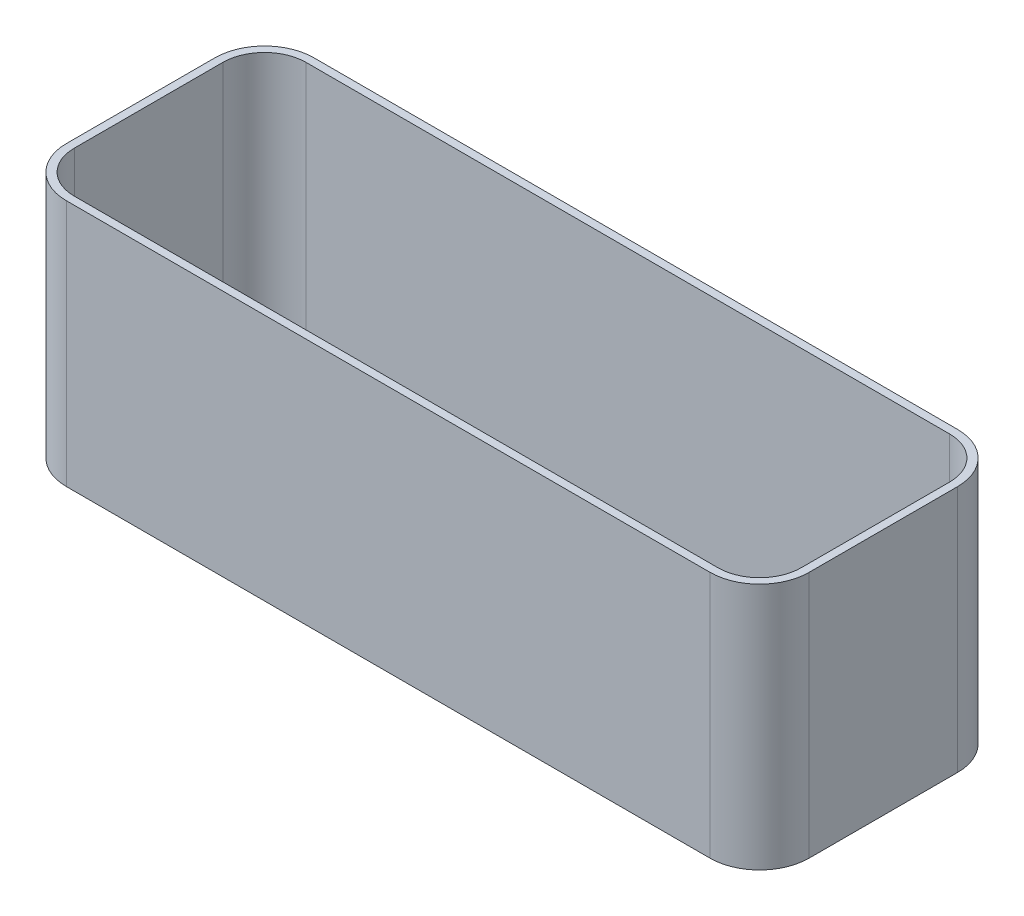
ISO-10303-21;
HEADER;
FILE_DESCRIPTION(('STEP AP214'),'2;1');
FILE_NAME('part.step','',(''),(''),'','','');
FILE_SCHEMA(('AUTOMOTIVE_DESIGN { 1 0 10303 214 1 1 1 1 }'));
ENDSEC;
DATA;
#1=APPLICATION_CONTEXT('core data for automotive mechanical design processes');
#2=APPLICATION_PROTOCOL_DEFINITION('international standard','automotive_design',2000,#1);
#3=PRODUCT_CONTEXT('',#1,'mechanical');
#4=PRODUCT('Part','Part','',(#3));
#5=PRODUCT_RELATED_PRODUCT_CATEGORY('part','',(#4));
#6=PRODUCT_DEFINITION_FORMATION('','',#4);
#7=PRODUCT_DEFINITION_CONTEXT('part definition',#1,'design');
#8=PRODUCT_DEFINITION('design','',#6,#7);
#9=PRODUCT_DEFINITION_SHAPE('','',#8);
#10=(LENGTH_UNIT() NAMED_UNIT(*) SI_UNIT(.MILLI.,.METRE.));
#11=(NAMED_UNIT(*) PLANE_ANGLE_UNIT() SI_UNIT($,.RADIAN.));
#12=(NAMED_UNIT(*) SI_UNIT($,.STERADIAN.) SOLID_ANGLE_UNIT());
#13=UNCERTAINTY_MEASURE_WITH_UNIT(LENGTH_MEASURE(1.E-05),#10,'distance_accuracy_value','');
#14=(GEOMETRIC_REPRESENTATION_CONTEXT(3) GLOBAL_UNCERTAINTY_ASSIGNED_CONTEXT((#13)) GLOBAL_UNIT_ASSIGNED_CONTEXT((#10,
#11,#12)) REPRESENTATION_CONTEXT('',''));
#15=CARTESIAN_POINT('',(0.,0.,0.));
#16=DIRECTION('',(0.,0.,1.));
#17=DIRECTION('',(1.,0.,0.));
#18=AXIS2_PLACEMENT_3D('',#15,#16,#17);
#19=CARTESIAN_POINT('',(140.,50.,-40.));
#20=DIRECTION('',(0.,-1.,0.));
#21=DIRECTION('',(0.,0.,-1.));
#22=AXIS2_PLACEMENT_3D('',#19,#20,#21);
#23=CYLINDRICAL_SURFACE('',#22,10.);
#24=CARTESIAN_POINT('',(140.,0.,-40.));
#25=DIRECTION('',(0.,1.,0.));
#26=DIRECTION('',(0.,0.,1.));
#27=AXIS2_PLACEMENT_3D('',#24,#25,#26);
#28=CIRCLE('',#27,10.);
#29=CARTESIAN_POINT('',(150.,0.,-39.9999999999999));
#30=VERTEX_POINT('',#29);
#31=CARTESIAN_POINT('',(140.,0.,-50.));
#32=VERTEX_POINT('',#31);
#33=EDGE_CURVE('E142',#30,#32,#28,.T.);
#34=ORIENTED_EDGE('',*,*,#33,.T.);
#35=DIRECTION('',(0.,-1.,0.));
#36=VECTOR('',#35,1.);
#37=CARTESIAN_POINT('',(140.,50.,-50.));
#38=LINE('',#37,#36);
#39=CARTESIAN_POINT('',(140.,50.,-50.));
#40=VERTEX_POINT('',#39);
#41=EDGE_CURVE('E11',#40,#32,#38,.T.);
#42=ORIENTED_EDGE('',*,*,#41,.F.);
#43=CARTESIAN_POINT('',(140.,50.,-40.));
#44=DIRECTION('',(0.,1.,0.));
#45=DIRECTION('',(0.,0.,1.));
#46=AXIS2_PLACEMENT_3D('',#43,#44,#45);
#47=CIRCLE('',#46,10.);
#48=CARTESIAN_POINT('',(150.,50.,-39.9999999999999));
#49=VERTEX_POINT('',#48);
#50=EDGE_CURVE('E158',#49,#40,#47,.T.);
#51=ORIENTED_EDGE('',*,*,#50,.F.);
#52=DIRECTION('',(0.,-1.,0.));
#53=VECTOR('',#52,1.);
#54=CARTESIAN_POINT('',(150.,50.,-39.9999999999999));
#55=LINE('',#54,#53);
#56=EDGE_CURVE('E138',#49,#30,#55,.T.);
#57=ORIENTED_EDGE('',*,*,#56,.T.);
#58=EDGE_LOOP('',(#34,#42,#51,#57));
#59=FACE_BOUND('',#58,.T.);
#60=ADVANCED_FACE('F35',(#59),#23,.T.);
#61=CARTESIAN_POINT('',(10.0000000000001,50.,-50.));
#62=DIRECTION('',(0.,0.,1.));
#63=DIRECTION('',(1.,0.,0.));
#64=AXIS2_PLACEMENT_3D('',#61,#62,#63);
#65=PLANE('',#64);
#66=DIRECTION('',(-1.,0.,0.));
#67=VECTOR('',#66,1.);
#68=CARTESIAN_POINT('',(10.0000000000001,0.,-50.));
#69=LINE('',#68,#67);
#70=CARTESIAN_POINT('',(10.,0.,-50.));
#71=VERTEX_POINT('',#70);
#72=EDGE_CURVE('E145',#32,#71,#69,.T.);
#73=ORIENTED_EDGE('',*,*,#72,.T.);
#74=DIRECTION('',(0.,-1.,0.));
#75=VECTOR('',#74,1.);
#76=CARTESIAN_POINT('',(10.,50.,-50.));
#77=LINE('',#76,#75);
#78=CARTESIAN_POINT('',(10.,50.,-50.));
#79=VERTEX_POINT('',#78);
#80=EDGE_CURVE('E42',#79,#71,#77,.T.);
#81=ORIENTED_EDGE('',*,*,#80,.F.);
#82=DIRECTION('',(-1.,0.,0.));
#83=VECTOR('',#82,1.);
#84=CARTESIAN_POINT('',(10.0000000000001,50.,-50.));
#85=LINE('',#84,#83);
#86=EDGE_CURVE('E99',#40,#79,#85,.T.);
#87=ORIENTED_EDGE('',*,*,#86,.F.);
#88=ORIENTED_EDGE('',*,*,#41,.T.);
#89=EDGE_LOOP('',(#73,#81,#87,#88));
#90=FACE_BOUND('',#89,.T.);
#91=ADVANCED_FACE('F327',(#90),#65,.F.);
#92=CARTESIAN_POINT('',(10.,50.,-40.));
#93=DIRECTION('',(0.,-1.,0.));
#94=DIRECTION('',(0.,0.,-1.));
#95=AXIS2_PLACEMENT_3D('',#92,#93,#94);
#96=CYLINDRICAL_SURFACE('',#95,10.);
#97=CARTESIAN_POINT('',(10.,0.,-40.));
#98=DIRECTION('',(0.,1.,0.));
#99=DIRECTION('',(0.,0.,-1.));
#100=AXIS2_PLACEMENT_3D('',#97,#98,#99);
#101=CIRCLE('',#100,10.);
#102=CARTESIAN_POINT('',(0.,0.,-39.9999999999999));
#103=VERTEX_POINT('',#102);
#104=EDGE_CURVE('E148',#71,#103,#101,.T.);
#105=ORIENTED_EDGE('',*,*,#104,.T.);
#106=DIRECTION('',(0.,-1.,0.));
#107=VECTOR('',#106,1.);
#108=CARTESIAN_POINT('',(0.,50.,-39.9999999999999));
#109=LINE('',#108,#107);
#110=CARTESIAN_POINT('',(0.,50.,-39.9999999999999));
#111=VERTEX_POINT('',#110);
#112=EDGE_CURVE('E165',#111,#103,#109,.T.);
#113=ORIENTED_EDGE('',*,*,#112,.F.);
#114=CARTESIAN_POINT('',(10.,50.,-40.));
#115=DIRECTION('',(0.,1.,0.));
#116=DIRECTION('',(0.,0.,-1.));
#117=AXIS2_PLACEMENT_3D('',#114,#115,#116);
#118=CIRCLE('',#117,10.);
#119=EDGE_CURVE('E173',#79,#111,#118,.T.);
#120=ORIENTED_EDGE('',*,*,#119,.F.);
#121=ORIENTED_EDGE('',*,*,#80,.T.);
#122=EDGE_LOOP('',(#105,#113,#120,#121));
#123=FACE_BOUND('',#122,.T.);
#124=ADVANCED_FACE('F171',(#123),#96,.T.);
#125=CARTESIAN_POINT('',(0.,50.,-10.0000000000001));
#126=DIRECTION('',(1.,0.,0.));
#127=DIRECTION('',(0.,0.,-1.));
#128=AXIS2_PLACEMENT_3D('',#125,#126,#127);
#129=PLANE('',#128);
#130=DIRECTION('',(0.,0.,1.));
#131=VECTOR('',#130,1.);
#132=CARTESIAN_POINT('',(0.,0.,-10.0000000000001));
#133=LINE('',#132,#131);
#134=CARTESIAN_POINT('',(0.,0.,-10.0000000000001));
#135=VERTEX_POINT('',#134);
#136=EDGE_CURVE('E150',#103,#135,#133,.T.);
#137=ORIENTED_EDGE('',*,*,#136,.T.);
#138=DIRECTION('',(0.,-1.,0.));
#139=VECTOR('',#138,1.);
#140=CARTESIAN_POINT('',(0.,50.,-10.0000000000001));
#141=LINE('',#140,#139);
#142=CARTESIAN_POINT('',(0.,50.,-10.0000000000001));
#143=VERTEX_POINT('',#142);
#144=EDGE_CURVE('E162',#143,#135,#141,.T.);
#145=ORIENTED_EDGE('',*,*,#144,.F.);
#146=DIRECTION('',(0.,0.,1.));
#147=VECTOR('',#146,1.);
#148=CARTESIAN_POINT('',(0.,50.,-10.0000000000001));
#149=LINE('',#148,#147);
#150=EDGE_CURVE('E185',#111,#143,#149,.T.);
#151=ORIENTED_EDGE('',*,*,#150,.F.);
#152=ORIENTED_EDGE('',*,*,#112,.T.);
#153=EDGE_LOOP('',(#137,#145,#151,#152));
#154=FACE_BOUND('',#153,.T.);
#155=ADVANCED_FACE('F181',(#154),#129,.F.);
#156=CARTESIAN_POINT('',(10.,50.,-10.));
#157=DIRECTION('',(0.,-1.,0.));
#158=DIRECTION('',(0.,0.,-1.));
#159=AXIS2_PLACEMENT_3D('',#156,#157,#158);
#160=CYLINDRICAL_SURFACE('',#159,10.);
#161=CARTESIAN_POINT('',(10.,0.,-10.));
#162=DIRECTION('',(0.,1.,0.));
#163=DIRECTION('',(0.,0.,-1.));
#164=AXIS2_PLACEMENT_3D('',#161,#162,#163);
#165=CIRCLE('',#164,10.);
#166=CARTESIAN_POINT('',(10.0000000000001,0.,0.));
#167=VERTEX_POINT('',#166);
#168=EDGE_CURVE('E152',#135,#167,#165,.T.);
#169=ORIENTED_EDGE('',*,*,#168,.T.);
#170=DIRECTION('',(0.,-1.,0.));
#171=VECTOR('',#170,1.);
#172=CARTESIAN_POINT('',(10.0000000000001,50.,0.));
#173=LINE('',#172,#171);
#174=CARTESIAN_POINT('',(10.0000000000001,50.,0.));
#175=VERTEX_POINT('',#174);
#176=EDGE_CURVE('E133',#175,#167,#173,.T.);
#177=ORIENTED_EDGE('',*,*,#176,.F.);
#178=CARTESIAN_POINT('',(10.,50.,-10.));
#179=DIRECTION('',(0.,1.,0.));
#180=DIRECTION('',(0.,0.,-1.));
#181=AXIS2_PLACEMENT_3D('',#178,#179,#180);
#182=CIRCLE('',#181,10.);
#183=EDGE_CURVE('E121',#143,#175,#182,.T.);
#184=ORIENTED_EDGE('',*,*,#183,.F.);
#185=ORIENTED_EDGE('',*,*,#144,.T.);
#186=EDGE_LOOP('',(#169,#177,#184,#185));
#187=FACE_BOUND('',#186,.T.);
#188=ADVANCED_FACE('F184',(#187),#160,.T.);
#189=CARTESIAN_POINT('',(10.0000000000001,50.,0.));
#190=DIRECTION('',(0.,0.,-1.));
#191=DIRECTION('',(-1.,0.,0.));
#192=AXIS2_PLACEMENT_3D('',#189,#190,#191);
#193=PLANE('',#192);
#194=DIRECTION('',(1.,0.,0.));
#195=VECTOR('',#194,1.);
#196=CARTESIAN_POINT('',(10.0000000000001,0.,0.));
#197=LINE('',#196,#195);
#198=CARTESIAN_POINT('',(140.,0.,0.));
#199=VERTEX_POINT('',#198);
#200=EDGE_CURVE('E130',#167,#199,#197,.T.);
#201=ORIENTED_EDGE('',*,*,#200,.T.);
#202=DIRECTION('',(0.,-1.,0.));
#203=VECTOR('',#202,1.);
#204=CARTESIAN_POINT('',(140.,50.,0.));
#205=LINE('',#204,#203);
#206=CARTESIAN_POINT('',(140.,50.,0.));
#207=VERTEX_POINT('',#206);
#208=EDGE_CURVE('E127',#207,#199,#205,.T.);
#209=ORIENTED_EDGE('',*,*,#208,.F.);
#210=DIRECTION('',(1.,0.,0.));
#211=VECTOR('',#210,1.);
#212=CARTESIAN_POINT('',(10.0000000000001,50.,0.));
#213=LINE('',#212,#211);
#214=EDGE_CURVE('E114',#175,#207,#213,.T.);
#215=ORIENTED_EDGE('',*,*,#214,.F.);
#216=ORIENTED_EDGE('',*,*,#176,.T.);
#217=EDGE_LOOP('',(#201,#209,#215,#216));
#218=FACE_BOUND('',#217,.T.);
#219=ADVANCED_FACE('F128',(#218),#193,.F.);
#220=CARTESIAN_POINT('',(140.,50.,-10.));
#221=DIRECTION('',(0.,-1.,0.));
#222=DIRECTION('',(0.,0.,-1.));
#223=AXIS2_PLACEMENT_3D('',#220,#221,#222);
#224=CYLINDRICAL_SURFACE('',#223,10.);
#225=CARTESIAN_POINT('',(140.,0.,-10.));
#226=DIRECTION('',(0.,1.,0.));
#227=DIRECTION('',(0.,0.,1.));
#228=AXIS2_PLACEMENT_3D('',#225,#226,#227);
#229=CIRCLE('',#228,10.);
#230=CARTESIAN_POINT('',(150.,0.,-10.0000000000001));
#231=VERTEX_POINT('',#230);
#232=EDGE_CURVE('E155',#199,#231,#229,.T.);
#233=ORIENTED_EDGE('',*,*,#232,.T.);
#234=DIRECTION('',(0.,-1.,0.));
#235=VECTOR('',#234,1.);
#236=CARTESIAN_POINT('',(150.,50.,-10.0000000000001));
#237=LINE('',#236,#235);
#238=CARTESIAN_POINT('',(150.,50.,-10.0000000000001));
#239=VERTEX_POINT('',#238);
#240=EDGE_CURVE('E134',#239,#231,#237,.T.);
#241=ORIENTED_EDGE('',*,*,#240,.F.);
#242=CARTESIAN_POINT('',(140.,50.,-10.));
#243=DIRECTION('',(0.,1.,0.));
#244=DIRECTION('',(0.,0.,1.));
#245=AXIS2_PLACEMENT_3D('',#242,#243,#244);
#246=CIRCLE('',#245,10.);
#247=EDGE_CURVE('E118',#207,#239,#246,.T.);
#248=ORIENTED_EDGE('',*,*,#247,.F.);
#249=ORIENTED_EDGE('',*,*,#208,.T.);
#250=EDGE_LOOP('',(#233,#241,#248,#249));
#251=FACE_BOUND('',#250,.T.);
#252=ADVANCED_FACE('F136',(#251),#224,.T.);
#253=CARTESIAN_POINT('',(150.,50.,-10.0000000000001));
#254=DIRECTION('',(-1.,0.,0.));
#255=DIRECTION('',(0.,0.,1.));
#256=AXIS2_PLACEMENT_3D('',#253,#254,#255);
#257=PLANE('',#256);
#258=DIRECTION('',(0.,0.,-1.));
#259=VECTOR('',#258,1.);
#260=CARTESIAN_POINT('',(150.,0.,-10.0000000000001));
#261=LINE('',#260,#259);
#262=EDGE_CURVE('E91',#231,#30,#261,.T.);
#263=ORIENTED_EDGE('',*,*,#262,.T.);
#264=ORIENTED_EDGE('',*,*,#56,.F.);
#265=DIRECTION('',(0.,0.,-1.));
#266=VECTOR('',#265,1.);
#267=CARTESIAN_POINT('',(150.,50.,-10.0000000000001));
#268=LINE('',#267,#266);
#269=EDGE_CURVE('E58',#239,#49,#268,.T.);
#270=ORIENTED_EDGE('',*,*,#269,.F.);
#271=ORIENTED_EDGE('',*,*,#240,.T.);
#272=EDGE_LOOP('',(#263,#264,#270,#271));
#273=FACE_BOUND('',#272,.T.);
#274=ADVANCED_FACE('F334',(#273),#257,.F.);
#275=CARTESIAN_POINT('',(140.,50.,-40.));
#276=DIRECTION('',(0.,1.,0.));
#277=DIRECTION('',(0.,0.,1.));
#278=AXIS2_PLACEMENT_3D('',#275,#276,#277);
#279=PLANE('',#278);
#280=CARTESIAN_POINT('',(140.,50.,-40.));
#281=DIRECTION('',(0.,1.,0.));
#282=DIRECTION('',(0.,0.,1.));
#283=AXIS2_PLACEMENT_3D('',#280,#281,#282);
#284=CIRCLE('',#283,8.4);
#285=CARTESIAN_POINT('',(148.4,50.,-39.9999999999999));
#286=VERTEX_POINT('',#285);
#287=CARTESIAN_POINT('',(140.,50.,-48.4));
#288=VERTEX_POINT('',#287);
#289=EDGE_CURVE('E211',#286,#288,#284,.T.);
#290=ORIENTED_EDGE('',*,*,#289,.F.);
#291=DIRECTION('',(0.,0.,-1.));
#292=VECTOR('',#291,1.);
#293=CARTESIAN_POINT('',(148.4,50.,-10.0000000000001));
#294=LINE('',#293,#292);
#295=CARTESIAN_POINT('',(148.4,50.,-10.0000000000001));
#296=VERTEX_POINT('',#295);
#297=EDGE_CURVE('E191',#296,#286,#294,.T.);
#298=ORIENTED_EDGE('',*,*,#297,.F.);
#299=CARTESIAN_POINT('',(140.,50.,-10.));
#300=DIRECTION('',(0.,1.,0.));
#301=DIRECTION('',(0.,0.,1.));
#302=AXIS2_PLACEMENT_3D('',#299,#300,#301);
#303=CIRCLE('',#302,8.4);
#304=CARTESIAN_POINT('',(140.,50.,-1.6));
#305=VERTEX_POINT('',#304);
#306=EDGE_CURVE('E194',#305,#296,#303,.T.);
#307=ORIENTED_EDGE('',*,*,#306,.F.);
#308=DIRECTION('',(1.,0.,0.));
#309=VECTOR('',#308,1.);
#310=CARTESIAN_POINT('',(10.0000000000001,50.,-1.6));
#311=LINE('',#310,#309);
#312=CARTESIAN_POINT('',(10.0000000000001,50.,-1.6));
#313=VERTEX_POINT('',#312);
#314=EDGE_CURVE('E196',#313,#305,#311,.T.);
#315=ORIENTED_EDGE('',*,*,#314,.F.);
#316=CARTESIAN_POINT('',(10.,50.,-10.));
#317=DIRECTION('',(0.,1.,0.));
#318=DIRECTION('',(0.,0.,1.));
#319=AXIS2_PLACEMENT_3D('',#316,#317,#318);
#320=CIRCLE('',#319,8.4);
#321=CARTESIAN_POINT('',(1.6,50.,-10.0000000000001));
#322=VERTEX_POINT('',#321);
#323=EDGE_CURVE('E199',#322,#313,#320,.T.);
#324=ORIENTED_EDGE('',*,*,#323,.F.);
#325=DIRECTION('',(0.,0.,1.));
#326=VECTOR('',#325,1.);
#327=CARTESIAN_POINT('',(1.6,50.,-10.0000000000001));
#328=LINE('',#327,#326);
#329=CARTESIAN_POINT('',(1.6,50.,-39.9999999999999));
#330=VERTEX_POINT('',#329);
#331=EDGE_CURVE('E202',#330,#322,#328,.T.);
#332=ORIENTED_EDGE('',*,*,#331,.F.);
#333=CARTESIAN_POINT('',(10.,50.,-40.));
#334=DIRECTION('',(0.,1.,0.));
#335=DIRECTION('',(0.,0.,1.));
#336=AXIS2_PLACEMENT_3D('',#333,#334,#335);
#337=CIRCLE('',#336,8.4);
#338=CARTESIAN_POINT('',(10.,50.,-48.4));
#339=VERTEX_POINT('',#338);
#340=EDGE_CURVE('E205',#339,#330,#337,.T.);
#341=ORIENTED_EDGE('',*,*,#340,.F.);
#342=DIRECTION('',(-1.,0.,0.));
#343=VECTOR('',#342,1.);
#344=CARTESIAN_POINT('',(10.0000000000001,50.,-48.4));
#345=LINE('',#344,#343);
#346=EDGE_CURVE('E208',#288,#339,#345,.T.);
#347=ORIENTED_EDGE('',*,*,#346,.F.);
#348=EDGE_LOOP('',(#290,#298,#307,#315,#324,#332,#341,#347));
#349=FACE_BOUND('',#348,.T.);
#350=ORIENTED_EDGE('',*,*,#50,.T.);
#351=ORIENTED_EDGE('',*,*,#86,.T.);
#352=ORIENTED_EDGE('',*,*,#119,.T.);
#353=ORIENTED_EDGE('',*,*,#150,.T.);
#354=ORIENTED_EDGE('',*,*,#183,.T.);
#355=ORIENTED_EDGE('',*,*,#214,.T.);
#356=ORIENTED_EDGE('',*,*,#247,.T.);
#357=ORIENTED_EDGE('',*,*,#269,.T.);
#358=EDGE_LOOP('',(#350,#351,#352,#353,#354,#355,#356,#357));
#359=FACE_BOUND('',#358,.T.);
#360=ADVANCED_FACE('F116',(#349,#359),#279,.T.);
#361=CARTESIAN_POINT('',(140.,0.,-40.));
#362=DIRECTION('',(0.,1.,0.));
#363=DIRECTION('',(0.,0.,1.));
#364=AXIS2_PLACEMENT_3D('',#361,#362,#363);
#365=PLANE('',#364);
#366=ORIENTED_EDGE('',*,*,#33,.F.);
#367=ORIENTED_EDGE('',*,*,#262,.F.);
#368=ORIENTED_EDGE('',*,*,#232,.F.);
#369=ORIENTED_EDGE('',*,*,#200,.F.);
#370=ORIENTED_EDGE('',*,*,#168,.F.);
#371=ORIENTED_EDGE('',*,*,#136,.F.);
#372=ORIENTED_EDGE('',*,*,#104,.F.);
#373=ORIENTED_EDGE('',*,*,#72,.F.);
#374=EDGE_LOOP('',(#366,#367,#368,#369,#370,#371,#372,#373));
#375=FACE_BOUND('',#374,.T.);
#376=ADVANCED_FACE('F177',(#375),#365,.F.);
#377=CARTESIAN_POINT('',(140.,50.,-40.));
#378=DIRECTION('',(0.,-1.,0.));
#379=DIRECTION('',(0.,0.,-1.));
#380=AXIS2_PLACEMENT_3D('',#377,#378,#379);
#381=CYLINDRICAL_SURFACE('',#380,8.4);
#382=CARTESIAN_POINT('',(140.,1.6,-40.));
#383=DIRECTION('',(0.,1.,0.));
#384=DIRECTION('',(0.,0.,1.));
#385=AXIS2_PLACEMENT_3D('',#382,#383,#384);
#386=CIRCLE('',#385,8.4);
#387=CARTESIAN_POINT('',(148.4,1.6,-39.9999999999999));
#388=VERTEX_POINT('',#387);
#389=CARTESIAN_POINT('',(140.,1.6,-48.4));
#390=VERTEX_POINT('',#389);
#391=EDGE_CURVE('E251',#388,#390,#386,.T.);
#392=ORIENTED_EDGE('',*,*,#391,.F.);
#393=DIRECTION('',(0.,-1.,0.));
#394=VECTOR('',#393,1.);
#395=CARTESIAN_POINT('',(148.4,50.,-39.9999999999999));
#396=LINE('',#395,#394);
#397=EDGE_CURVE('E193',#286,#388,#396,.T.);
#398=ORIENTED_EDGE('',*,*,#397,.F.);
#399=ORIENTED_EDGE('',*,*,#289,.T.);
#400=DIRECTION('',(0.,1.,0.));
#401=VECTOR('',#400,1.);
#402=CARTESIAN_POINT('',(140.,50.,-48.4));
#403=LINE('',#402,#401);
#404=EDGE_CURVE('E146',#288,#390,#403,.F.);
#405=ORIENTED_EDGE('',*,*,#404,.T.);
#406=EDGE_LOOP('',(#392,#398,#399,#405));
#407=FACE_BOUND('',#406,.T.);
#408=ADVANCED_FACE('F267',(#407),#381,.F.);
#409=CARTESIAN_POINT('',(10.0000000000001,50.,-48.4));
#410=DIRECTION('',(0.,0.,1.));
#411=DIRECTION('',(1.,0.,0.));
#412=AXIS2_PLACEMENT_3D('',#409,#410,#411);
#413=PLANE('',#412);
#414=DIRECTION('',(-1.,0.,0.));
#415=VECTOR('',#414,1.);
#416=CARTESIAN_POINT('',(10.0000000000001,1.6,-48.4));
#417=LINE('',#416,#415);
#418=CARTESIAN_POINT('',(10.,1.6,-48.4));
#419=VERTEX_POINT('',#418);
#420=EDGE_CURVE('E246',#390,#419,#417,.T.);
#421=ORIENTED_EDGE('',*,*,#420,.F.);
#422=ORIENTED_EDGE('',*,*,#404,.F.);
#423=ORIENTED_EDGE('',*,*,#346,.T.);
#424=DIRECTION('',(0.,-1.,0.));
#425=VECTOR('',#424,1.);
#426=CARTESIAN_POINT('',(10.,50.,-48.4));
#427=LINE('',#426,#425);
#428=EDGE_CURVE('E243',#339,#419,#427,.T.);
#429=ORIENTED_EDGE('',*,*,#428,.T.);
#430=EDGE_LOOP('',(#421,#422,#423,#429));
#431=FACE_BOUND('',#430,.T.);
#432=ADVANCED_FACE('F297',(#431),#413,.T.);
#433=CARTESIAN_POINT('',(10.,50.,-40.));
#434=DIRECTION('',(0.,-1.,0.));
#435=DIRECTION('',(0.,0.,-1.));
#436=AXIS2_PLACEMENT_3D('',#433,#434,#435);
#437=CYLINDRICAL_SURFACE('',#436,8.4);
#438=CARTESIAN_POINT('',(10.,1.6,-40.));
#439=DIRECTION('',(0.,1.,0.));
#440=DIRECTION('',(0.,0.,1.));
#441=AXIS2_PLACEMENT_3D('',#438,#439,#440);
#442=CIRCLE('',#441,8.4);
#443=CARTESIAN_POINT('',(1.6,1.6,-39.9999999999999));
#444=VERTEX_POINT('',#443);
#445=EDGE_CURVE('E240',#419,#444,#442,.T.);
#446=ORIENTED_EDGE('',*,*,#445,.F.);
#447=ORIENTED_EDGE('',*,*,#428,.F.);
#448=ORIENTED_EDGE('',*,*,#340,.T.);
#449=DIRECTION('',(0.,1.,0.));
#450=VECTOR('',#449,1.);
#451=CARTESIAN_POINT('',(1.6,50.,-39.9999999999999));
#452=LINE('',#451,#450);
#453=EDGE_CURVE('E237',#330,#444,#452,.F.);
#454=ORIENTED_EDGE('',*,*,#453,.T.);
#455=EDGE_LOOP('',(#446,#447,#448,#454));
#456=FACE_BOUND('',#455,.T.);
#457=ADVANCED_FACE('F303',(#456),#437,.F.);
#458=CARTESIAN_POINT('',(1.6,50.,-10.0000000000001));
#459=DIRECTION('',(1.,0.,0.));
#460=DIRECTION('',(0.,0.,-1.));
#461=AXIS2_PLACEMENT_3D('',#458,#459,#460);
#462=PLANE('',#461);
#463=DIRECTION('',(0.,0.,1.));
#464=VECTOR('',#463,1.);
#465=CARTESIAN_POINT('',(1.6,1.6,-10.0000000000001));
#466=LINE('',#465,#464);
#467=CARTESIAN_POINT('',(1.6,1.6,-10.0000000000001));
#468=VERTEX_POINT('',#467);
#469=EDGE_CURVE('E234',#444,#468,#466,.T.);
#470=ORIENTED_EDGE('',*,*,#469,.F.);
#471=ORIENTED_EDGE('',*,*,#453,.F.);
#472=ORIENTED_EDGE('',*,*,#331,.T.);
#473=DIRECTION('',(0.,-1.,0.));
#474=VECTOR('',#473,1.);
#475=CARTESIAN_POINT('',(1.6,50.,-10.0000000000001));
#476=LINE('',#475,#474);
#477=EDGE_CURVE('E231',#322,#468,#476,.T.);
#478=ORIENTED_EDGE('',*,*,#477,.T.);
#479=EDGE_LOOP('',(#470,#471,#472,#478));
#480=FACE_BOUND('',#479,.T.);
#481=ADVANCED_FACE('F414',(#480),#462,.T.);
#482=CARTESIAN_POINT('',(10.,50.,-10.));
#483=DIRECTION('',(0.,-1.,0.));
#484=DIRECTION('',(0.,0.,-1.));
#485=AXIS2_PLACEMENT_3D('',#482,#483,#484);
#486=CYLINDRICAL_SURFACE('',#485,8.4);
#487=CARTESIAN_POINT('',(10.,1.6,-10.));
#488=DIRECTION('',(0.,1.,0.));
#489=DIRECTION('',(0.,0.,1.));
#490=AXIS2_PLACEMENT_3D('',#487,#488,#489);
#491=CIRCLE('',#490,8.4);
#492=CARTESIAN_POINT('',(10.0000000000001,1.6,-1.6));
#493=VERTEX_POINT('',#492);
#494=EDGE_CURVE('E228',#468,#493,#491,.T.);
#495=ORIENTED_EDGE('',*,*,#494,.F.);
#496=ORIENTED_EDGE('',*,*,#477,.F.);
#497=ORIENTED_EDGE('',*,*,#323,.T.);
#498=DIRECTION('',(0.,1.,0.));
#499=VECTOR('',#498,1.);
#500=CARTESIAN_POINT('',(10.0000000000001,50.,-1.6));
#501=LINE('',#500,#499);
#502=EDGE_CURVE('E225',#313,#493,#501,.F.);
#503=ORIENTED_EDGE('',*,*,#502,.T.);
#504=EDGE_LOOP('',(#495,#496,#497,#503));
#505=FACE_BOUND('',#504,.T.);
#506=ADVANCED_FACE('F324',(#505),#486,.F.);
#507=CARTESIAN_POINT('',(10.0000000000001,50.,-1.6));
#508=DIRECTION('',(0.,0.,-1.));
#509=DIRECTION('',(-1.,0.,0.));
#510=AXIS2_PLACEMENT_3D('',#507,#508,#509);
#511=PLANE('',#510);
#512=DIRECTION('',(1.,0.,0.));
#513=VECTOR('',#512,1.);
#514=CARTESIAN_POINT('',(10.0000000000001,1.6,-1.6));
#515=LINE('',#514,#513);
#516=CARTESIAN_POINT('',(140.,1.6,-1.6));
#517=VERTEX_POINT('',#516);
#518=EDGE_CURVE('E222',#493,#517,#515,.T.);
#519=ORIENTED_EDGE('',*,*,#518,.F.);
#520=ORIENTED_EDGE('',*,*,#502,.F.);
#521=ORIENTED_EDGE('',*,*,#314,.T.);
#522=DIRECTION('',(0.,-1.,0.));
#523=VECTOR('',#522,1.);
#524=CARTESIAN_POINT('',(140.,50.,-1.6));
#525=LINE('',#524,#523);
#526=EDGE_CURVE('E219',#305,#517,#525,.T.);
#527=ORIENTED_EDGE('',*,*,#526,.T.);
#528=EDGE_LOOP('',(#519,#520,#521,#527));
#529=FACE_BOUND('',#528,.T.);
#530=ADVANCED_FACE('F314',(#529),#511,.T.);
#531=CARTESIAN_POINT('',(140.,50.,-10.));
#532=DIRECTION('',(0.,-1.,0.));
#533=DIRECTION('',(0.,0.,-1.));
#534=AXIS2_PLACEMENT_3D('',#531,#532,#533);
#535=CYLINDRICAL_SURFACE('',#534,8.4);
#536=CARTESIAN_POINT('',(140.,1.6,-10.));
#537=DIRECTION('',(0.,1.,0.));
#538=DIRECTION('',(0.,0.,1.));
#539=AXIS2_PLACEMENT_3D('',#536,#537,#538);
#540=CIRCLE('',#539,8.4);
#541=CARTESIAN_POINT('',(148.4,1.6,-10.0000000000001));
#542=VERTEX_POINT('',#541);
#543=EDGE_CURVE('E217',#517,#542,#540,.T.);
#544=ORIENTED_EDGE('',*,*,#543,.F.);
#545=ORIENTED_EDGE('',*,*,#526,.F.);
#546=ORIENTED_EDGE('',*,*,#306,.T.);
#547=DIRECTION('',(0.,1.,0.));
#548=VECTOR('',#547,1.);
#549=CARTESIAN_POINT('',(148.4,50.,-10.0000000000001));
#550=LINE('',#549,#548);
#551=EDGE_CURVE('E49',#296,#542,#550,.F.);
#552=ORIENTED_EDGE('',*,*,#551,.T.);
#553=EDGE_LOOP('',(#544,#545,#546,#552));
#554=FACE_BOUND('',#553,.T.);
#555=ADVANCED_FACE('F316',(#554),#535,.F.);
#556=CARTESIAN_POINT('',(148.4,50.,-10.0000000000001));
#557=DIRECTION('',(-1.,0.,0.));
#558=DIRECTION('',(0.,0.,1.));
#559=AXIS2_PLACEMENT_3D('',#556,#557,#558);
#560=PLANE('',#559);
#561=DIRECTION('',(0.,0.,-1.));
#562=VECTOR('',#561,1.);
#563=CARTESIAN_POINT('',(148.4,1.6,-10.0000000000001));
#564=LINE('',#563,#562);
#565=EDGE_CURVE('E214',#542,#388,#564,.T.);
#566=ORIENTED_EDGE('',*,*,#565,.F.);
#567=ORIENTED_EDGE('',*,*,#551,.F.);
#568=ORIENTED_EDGE('',*,*,#297,.T.);
#569=ORIENTED_EDGE('',*,*,#397,.T.);
#570=EDGE_LOOP('',(#566,#567,#568,#569));
#571=FACE_BOUND('',#570,.T.);
#572=ADVANCED_FACE('F291',(#571),#560,.T.);
#573=CARTESIAN_POINT('',(140.,1.6,-40.));
#574=DIRECTION('',(0.,1.,0.));
#575=DIRECTION('',(0.,0.,1.));
#576=AXIS2_PLACEMENT_3D('',#573,#574,#575);
#577=PLANE('',#576);
#578=ORIENTED_EDGE('',*,*,#391,.T.);
#579=ORIENTED_EDGE('',*,*,#420,.T.);
#580=ORIENTED_EDGE('',*,*,#445,.T.);
#581=ORIENTED_EDGE('',*,*,#469,.T.);
#582=ORIENTED_EDGE('',*,*,#494,.T.);
#583=ORIENTED_EDGE('',*,*,#518,.T.);
#584=ORIENTED_EDGE('',*,*,#543,.T.);
#585=ORIENTED_EDGE('',*,*,#565,.T.);
#586=EDGE_LOOP('',(#578,#579,#580,#581,#582,#583,#584,#585));
#587=FACE_BOUND('',#586,.T.);
#588=ADVANCED_FACE('F260',(#587),#577,.T.);
#589=CLOSED_SHELL('',(#60,#91,#124,#155,#188,#219,#252,#274,#360,#376,#408,#432,#457,#481,#506,
#530,#555,#572,#588));
#590=MANIFOLD_SOLID_BREP('B2',#589);
#591=ADVANCED_BREP_SHAPE_REPRESENTATION('',(#18,#590),#14);
#592=SHAPE_DEFINITION_REPRESENTATION(#9,#591);
ENDSEC;
END-ISO-10303-21;
